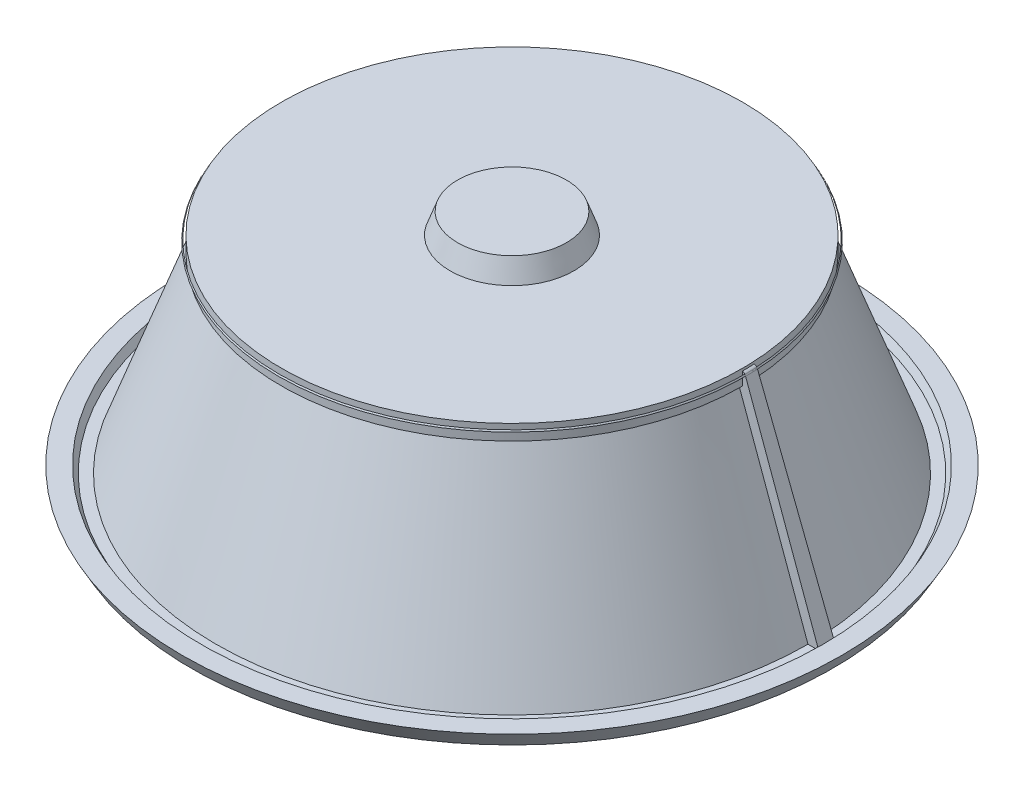
ISO-10303-21;
HEADER;
FILE_DESCRIPTION(('STEP AP214'),'2;1');
FILE_NAME('part.step','',(''),(''),'','','');
FILE_SCHEMA(('AUTOMOTIVE_DESIGN { 1 0 10303 214 1 1 1 1 }'));
ENDSEC;
DATA;
#1=APPLICATION_CONTEXT('core data for automotive mechanical design processes');
#2=APPLICATION_PROTOCOL_DEFINITION('international standard','automotive_design',2000,#1);
#3=PRODUCT_CONTEXT('',#1,'mechanical');
#4=PRODUCT('Part','Part','',(#3));
#5=PRODUCT_RELATED_PRODUCT_CATEGORY('part','',(#4));
#6=PRODUCT_DEFINITION_FORMATION('','',#4);
#7=PRODUCT_DEFINITION_CONTEXT('part definition',#1,'design');
#8=PRODUCT_DEFINITION('design','',#6,#7);
#9=PRODUCT_DEFINITION_SHAPE('','',#8);
#10=(LENGTH_UNIT() NAMED_UNIT(*) SI_UNIT(.MILLI.,.METRE.));
#11=(NAMED_UNIT(*) PLANE_ANGLE_UNIT() SI_UNIT($,.RADIAN.));
#12=(NAMED_UNIT(*) SI_UNIT($,.STERADIAN.) SOLID_ANGLE_UNIT());
#13=UNCERTAINTY_MEASURE_WITH_UNIT(LENGTH_MEASURE(1.E-05),#10,'distance_accuracy_value','');
#14=(GEOMETRIC_REPRESENTATION_CONTEXT(3) GLOBAL_UNCERTAINTY_ASSIGNED_CONTEXT((#13)) GLOBAL_UNIT_ASSIGNED_CONTEXT((#10,
#11,#12)) REPRESENTATION_CONTEXT('',''));
#15=CARTESIAN_POINT('',(0.,0.,0.));
#16=DIRECTION('',(0.,0.,1.));
#17=DIRECTION('',(1.,0.,0.));
#18=AXIS2_PLACEMENT_3D('',#15,#16,#17);
#19=CARTESIAN_POINT('',(0.,510.28650056125,0.));
#20=DIRECTION('',(0.,-1.,0.));
#21=DIRECTION('',(0.,0.,-1.));
#22=AXIS2_PLACEMENT_3D('',#19,#20,#21);
#23=CONICAL_SURFACE('',#22,564.208131214711,0.505849474138413);
#24=CARTESIAN_POINT('',(0.,506.840402866513,0.));
#25=DIRECTION('',(0.,-1.,0.));
#26=DIRECTION('',(0.,0.,-1.));
#27=AXIS2_PLACEMENT_3D('',#24,#25,#26);
#28=CIRCLE('',#27,566.117001075133);
#29=CARTESIAN_POINT('',(0.,506.840402866513,-566.117001075133));
#30=VERTEX_POINT('',#29);
#31=EDGE_CURVE('E11',#30,#30,#28,.T.);
#32=ORIENTED_EDGE('',*,*,#31,.T.);
#33=EDGE_LOOP('',(#32));
#34=FACE_BOUND('',#33,.T.);
#35=CARTESIAN_POINT('',(0.,510.28650056125,0.));
#36=DIRECTION('',(0.,-1.,0.));
#37=DIRECTION('',(0.,0.,-1.));
#38=AXIS2_PLACEMENT_3D('',#35,#36,#37);
#39=CIRCLE('',#38,564.208131214711);
#40=CARTESIAN_POINT('',(0.,510.28650056125,-564.208131214711));
#41=VERTEX_POINT('',#40);
#42=EDGE_CURVE('E53',#41,#41,#39,.T.);
#43=ORIENTED_EDGE('',*,*,#42,.F.);
#44=EDGE_LOOP('',(#43));
#45=FACE_BOUND('',#44,.T.);
#46=ADVANCED_FACE('F47',(#34,#45),#23,.F.);
#47=CARTESIAN_POINT('',(0.,502.5258203143,0.));
#48=DIRECTION('',(0.,-1.,0.));
#49=DIRECTION('',(0.,0.,-1.));
#50=AXIS2_PLACEMENT_3D('',#47,#48,#49);
#51=TOROIDAL_SURFACE('',#50,554.262782938554,12.6149954510278);
#52=ORIENTED_EDGE('',*,*,#42,.T.);
#53=EDGE_LOOP('',(#52));
#54=FACE_BOUND('',#53,.T.);
#55=ORIENTED_EDGE('',*,*,#31,.F.);
#56=EDGE_LOOP('',(#55));
#57=FACE_BOUND('',#56,.T.);
#58=ADVANCED_FACE('F59',(#54,#57),#51,.T.);
#59=CLOSED_SHELL('',(#46,#58));
#60=MANIFOLD_SOLID_BREP('B2',#59);
#61=CARTESIAN_POINT('',(0.,20.,0.));
#62=DIRECTION('',(0.,1.,0.));
#63=DIRECTION('',(0.,0.,1.));
#64=AXIS2_PLACEMENT_3D('',#61,#62,#63);
#65=PLANE('',#64);
#66=CARTESIAN_POINT('',(-730.042366910368,20.,19.1168321620943));
#67=DIRECTION('',(0.,1.,0.));
#68=DIRECTION('',(0.,0.,1.));
#69=AXIS2_PLACEMENT_3D('',#66,#67,#68);
#70=CIRCLE('',#69,7.49999999999995);
#71=CARTESIAN_POINT('',(-730.042366910368,20.,26.6168321620942));
#72=VERTEX_POINT('',#71);
#73=EDGE_CURVE('E439',#72,#72,#70,.T.);
#74=ORIENTED_EDGE('',*,*,#73,.F.);
#75=EDGE_LOOP('',(#74));
#76=FACE_BOUND('',#75,.T.);
#77=CARTESIAN_POINT('',(0.,20.,0.));
#78=DIRECTION('',(0.,-1.,0.));
#79=DIRECTION('',(0.,0.,-1.));
#80=AXIS2_PLACEMENT_3D('',#77,#78,#79);
#81=CIRCLE('',#80,717.272823346812);
#82=CARTESIAN_POINT('',(717.272823346812,20.,0.));
#83=VERTEX_POINT('',#82);
#84=CARTESIAN_POINT('',(716.289825870927,20.,-37.5391590969316));
#85=VERTEX_POINT('',#84);
#86=EDGE_CURVE('E196',#83,#85,#81,.T.);
#87=ORIENTED_EDGE('',*,*,#86,.T.);
#88=DIRECTION('',(-0.998629534754574,0.,0.0523359562429439));
#89=VECTOR('',#88,1.);
#90=CARTESIAN_POINT('',(0.,20.0000000000004,0.));
#91=LINE('',#90,#89);
#92=CARTESIAN_POINT('',(742.293732723324,20.,-38.9019661077488));
#93=VERTEX_POINT('',#92);
#94=EDGE_CURVE('E181',#93,#85,#91,.T.);
#95=ORIENTED_EDGE('',*,*,#94,.F.);
#96=CARTESIAN_POINT('',(0.,20.,0.));
#97=DIRECTION('',(0.,-1.,0.));
#98=DIRECTION('',(0.,0.,-1.));
#99=AXIS2_PLACEMENT_3D('',#96,#97,#98);
#100=CIRCLE('',#99,743.312416556708);
#101=CARTESIAN_POINT('',(743.312416556708,20.,0.));
#102=VERTEX_POINT('',#101);
#103=EDGE_CURVE('E199',#102,#93,#100,.T.);
#104=ORIENTED_EDGE('',*,*,#103,.F.);
#105=DIRECTION('',(-1.,0.,0.));
#106=VECTOR('',#105,1.);
#107=CARTESIAN_POINT('',(0.,20.0000000000004,0.));
#108=LINE('',#107,#106);
#109=EDGE_CURVE('E165',#102,#83,#108,.T.);
#110=ORIENTED_EDGE('',*,*,#109,.T.);
#111=EDGE_LOOP('',(#87,#95,#104,#110));
#112=FACE_BOUND('',#111,.T.);
#113=ADVANCED_FACE('F79',(#76,#112),#65,.T.);
#114=CARTESIAN_POINT('',(0.,482.799423723823,0.));
#115=DIRECTION('',(0.,-1.,0.));
#116=DIRECTION('',(0.,0.,-1.));
#117=AXIS2_PLACEMENT_3D('',#114,#115,#116);
#118=CONICAL_SURFACE('',#117,548.82760867579,0.349065850398863);
#119=DIRECTION('',(0.341551416606003,-0.939692620785909,-0.0178999512552975));
#120=VECTOR('',#119,1.);
#121=CARTESIAN_POINT('',(638.918900237079,232.866597374915,-33.4843207033883));
#122=LINE('',#121,#120);
#123=CARTESIAN_POINT('',(548.07545951237,482.799423723823,-28.7234177125757));
#124=VERTEX_POINT('',#123);
#125=EDGE_CURVE('E178',#124,#85,#122,.T.);
#126=ORIENTED_EDGE('',*,*,#125,.T.);
#127=ORIENTED_EDGE('',*,*,#86,.F.);
#128=DIRECTION('',(0.342020143325666,-0.939692620785909,0.));
#129=VECTOR('',#128,1.);
#130=CARTESIAN_POINT('',(639.795718032816,232.866597374915,0.));
#131=LINE('',#130,#129);
#132=CARTESIAN_POINT('',(548.82760867579,482.799423723823,0.));
#133=VERTEX_POINT('',#132);
#134=EDGE_CURVE('E163',#133,#83,#131,.T.);
#135=ORIENTED_EDGE('',*,*,#134,.F.);
#136=CARTESIAN_POINT('',(0.,482.799423723823,0.));
#137=DIRECTION('',(0.,-1.,0.));
#138=DIRECTION('',(0.,0.,-1.));
#139=AXIS2_PLACEMENT_3D('',#136,#137,#138);
#140=CIRCLE('',#139,548.82760867579);
#141=EDGE_CURVE('E193',#133,#124,#140,.T.);
#142=ORIENTED_EDGE('',*,*,#141,.T.);
#143=EDGE_LOOP('',(#126,#127,#135,#142));
#144=FACE_BOUND('',#143,.T.);
#145=ADVANCED_FACE('F232',(#144),#118,.T.);
#146=CARTESIAN_POINT('',(2.68007518246977E-12,482.799423723823,0.));
#147=DIRECTION('',(0.,1.,0.));
#148=DIRECTION('',(0.,0.,1.));
#149=AXIS2_PLACEMENT_3D('',#146,#147,#148);
#150=PLANE('',#149);
#151=DIRECTION('',(-0.998629534754574,0.,0.0523359562429439));
#152=VECTOR('',#151,1.);
#153=CARTESIAN_POINT('',(2.67640223257707E-12,482.799423723826,-1.40264297477538E-13));
#154=LINE('',#153,#152);
#155=CARTESIAN_POINT('',(558.061754859915,482.799423723823,-29.2467772750051));
#156=VERTEX_POINT('',#155);
#157=EDGE_CURVE('E175',#156,#124,#154,.T.);
#158=ORIENTED_EDGE('',*,*,#157,.T.);
#159=ORIENTED_EDGE('',*,*,#141,.F.);
#160=DIRECTION('',(-1.,0.,0.));
#161=VECTOR('',#160,1.);
#162=CARTESIAN_POINT('',(2.68007518246977E-12,482.799423723826,0.));
#163=LINE('',#162,#161);
#164=CARTESIAN_POINT('',(558.82760867579,482.799423723823,0.));
#165=VERTEX_POINT('',#164);
#166=EDGE_CURVE('E158',#165,#133,#163,.T.);
#167=ORIENTED_EDGE('',*,*,#166,.F.);
#168=CARTESIAN_POINT('',(0.,482.799423723823,0.));
#169=DIRECTION('',(0.,-1.,0.));
#170=DIRECTION('',(0.,0.,-1.));
#171=AXIS2_PLACEMENT_3D('',#168,#169,#170);
#172=CIRCLE('',#171,558.82760867579);
#173=EDGE_CURVE('E190',#165,#156,#172,.T.);
#174=ORIENTED_EDGE('',*,*,#173,.T.);
#175=EDGE_LOOP('',(#158,#159,#167,#174));
#176=FACE_BOUND('',#175,.T.);
#177=ADVANCED_FACE('F238',(#176),#150,.F.);
#178=CARTESIAN_POINT('',(0.,0.,0.));
#179=DIRECTION('',(0.,-1.,0.));
#180=DIRECTION('',(0.,0.,-1.));
#181=AXIS2_PLACEMENT_3D('',#178,#179,#180);
#182=CYLINDRICAL_SURFACE('',#181,558.82760867579);
#183=CARTESIAN_POINT('',(0.,520.,0.));
#184=DIRECTION('',(0.,-1.,0.));
#185=DIRECTION('',(0.,0.,-1.));
#186=AXIS2_PLACEMENT_3D('',#183,#184,#185);
#187=CIRCLE('',#186,558.82760867579);
#188=CARTESIAN_POINT('',(0.,520.,-558.82760867579));
#189=VERTEX_POINT('',#188);
#190=EDGE_CURVE('E145',#189,#189,#187,.T.);
#191=ORIENTED_EDGE('',*,*,#190,.T.);
#192=EDGE_LOOP('',(#191));
#193=FACE_BOUND('',#192,.T.);
#194=DIRECTION('',(0.,-1.,0.));
#195=VECTOR('',#194,1.);
#196=CARTESIAN_POINT('',(558.061754859915,0.,-29.2467772750051));
#197=LINE('',#196,#195);
#198=CARTESIAN_POINT('',(558.061754859915,514.28594260185,-29.2467772750051));
#199=VERTEX_POINT('',#198);
#200=EDGE_CURVE('E172',#199,#156,#197,.T.);
#201=ORIENTED_EDGE('',*,*,#200,.T.);
#202=ORIENTED_EDGE('',*,*,#173,.F.);
#203=DIRECTION('',(0.,-1.,0.));
#204=VECTOR('',#203,1.);
#205=CARTESIAN_POINT('',(558.82760867579,0.,0.));
#206=LINE('',#205,#204);
#207=CARTESIAN_POINT('',(558.82760867579,514.28594260185,0.));
#208=VERTEX_POINT('',#207);
#209=EDGE_CURVE('E156',#208,#165,#206,.T.);
#210=ORIENTED_EDGE('',*,*,#209,.F.);
#211=CARTESIAN_POINT('',(0.,514.28594260185,0.));
#212=DIRECTION('',(0.,-1.,0.));
#213=DIRECTION('',(0.,0.,-1.));
#214=AXIS2_PLACEMENT_3D('',#211,#212,#213);
#215=CIRCLE('',#214,558.82760867579);
#216=EDGE_CURVE('E146',#199,#208,#215,.T.);
#217=ORIENTED_EDGE('',*,*,#216,.F.);
#218=EDGE_LOOP('',(#201,#202,#210,#217));
#219=FACE_BOUND('',#218,.T.);
#220=ADVANCED_FACE('F371',(#193,#219),#182,.T.);
#221=CARTESIAN_POINT('',(2.15703056918176E-13,520.,0.));
#222=DIRECTION('',(0.,-1.,0.));
#223=DIRECTION('',(0.,0.,-1.));
#224=AXIS2_PLACEMENT_3D('',#221,#222,#223);
#225=PLANE('',#224);
#226=CARTESIAN_POINT('',(0.,520.,0.));
#227=DIRECTION('',(0.,1.,0.));
#228=DIRECTION('',(0.,0.,1.));
#229=AXIS2_PLACEMENT_3D('',#226,#227,#228);
#230=CIRCLE('',#229,150.);
#231=CARTESIAN_POINT('',(0.,520.,150.));
#232=VERTEX_POINT('',#231);
#233=EDGE_CURVE('E45',#232,#232,#230,.T.);
#234=ORIENTED_EDGE('',*,*,#233,.F.);
#235=EDGE_LOOP('',(#234));
#236=FACE_BOUND('',#235,.T.);
#237=ORIENTED_EDGE('',*,*,#190,.F.);
#238=EDGE_LOOP('',(#237));
#239=FACE_BOUND('',#238,.T.);
#240=ADVANCED_FACE('F81',(#236,#239),#225,.F.);
#241=CARTESIAN_POINT('',(-1.11022302462516E-13,500.,0.));
#242=DIRECTION('',(0.,1.,0.));
#243=DIRECTION('',(0.,0.,1.));
#244=AXIS2_PLACEMENT_3D('',#241,#242,#243);
#245=PLANE('',#244);
#246=CARTESIAN_POINT('',(0.,500.,0.));
#247=DIRECTION('',(0.,-1.,0.));
#248=DIRECTION('',(0.,0.,-1.));
#249=AXIS2_PLACEMENT_3D('',#246,#247,#248);
#250=CIRCLE('',#249,500.);
#251=CARTESIAN_POINT('',(0.,500.,-500.));
#252=VERTEX_POINT('',#251);
#253=EDGE_CURVE('E83',#252,#252,#250,.T.);
#254=ORIENTED_EDGE('',*,*,#253,.T.);
#255=EDGE_LOOP('',(#254));
#256=FACE_BOUND('',#255,.T.);
#257=ADVANCED_FACE('F218',(#256),#245,.F.);
#258=CARTESIAN_POINT('',(0.,0.,0.));
#259=DIRECTION('',(0.,-1.,0.));
#260=DIRECTION('',(0.,0.,-1.));
#261=AXIS2_PLACEMENT_3D('',#258,#259,#260);
#262=CONICAL_SURFACE('',#261,681.985117133099,0.349065850398863);
#263=ORIENTED_EDGE('',*,*,#253,.F.);
#264=EDGE_LOOP('',(#263));
#265=FACE_BOUND('',#264,.T.);
#266=CARTESIAN_POINT('',(0.,0.,0.));
#267=DIRECTION('',(0.,-1.,0.));
#268=DIRECTION('',(0.,0.,-1.));
#269=AXIS2_PLACEMENT_3D('',#266,#267,#268);
#270=CIRCLE('',#269,681.985117133099);
#271=CARTESIAN_POINT('',(0.,0.,-681.985117133099));
#272=VERTEX_POINT('',#271);
#273=EDGE_CURVE('E211',#272,#272,#270,.T.);
#274=ORIENTED_EDGE('',*,*,#273,.T.);
#275=EDGE_LOOP('',(#274));
#276=FACE_BOUND('',#275,.T.);
#277=ADVANCED_FACE('F220',(#265,#276),#262,.F.);
#278=CARTESIAN_POINT('',(0.,0.,0.));
#279=DIRECTION('',(0.,1.,0.));
#280=DIRECTION('',(0.,0.,1.));
#281=AXIS2_PLACEMENT_3D('',#278,#279,#280);
#282=PLANE('',#281);
#283=CARTESIAN_POINT('',(-730.042366910368,0.,19.1168321620943));
#284=DIRECTION('',(0.,1.,0.));
#285=DIRECTION('',(0.,0.,1.));
#286=AXIS2_PLACEMENT_3D('',#283,#284,#285);
#287=CIRCLE('',#286,7.49999999999995);
#288=CARTESIAN_POINT('',(-730.042366910368,0.,26.6168321620942));
#289=VERTEX_POINT('',#288);
#290=EDGE_CURVE('E151',#289,#289,#287,.T.);
#291=ORIENTED_EDGE('',*,*,#290,.T.);
#292=EDGE_LOOP('',(#291));
#293=FACE_BOUND('',#292,.T.);
#294=ORIENTED_EDGE('',*,*,#273,.F.);
#295=EDGE_LOOP('',(#294));
#296=FACE_BOUND('',#295,.T.);
#297=CARTESIAN_POINT('',(0.,0.,0.));
#298=DIRECTION('',(0.,-1.,0.));
#299=DIRECTION('',(0.,0.,-1.));
#300=AXIS2_PLACEMENT_3D('',#297,#298,#299);
#301=CIRCLE('',#300,777.955923258893);
#302=CARTESIAN_POINT('',(0.,0.,-777.955923258893));
#303=VERTEX_POINT('',#302);
#304=EDGE_CURVE('E209',#303,#303,#301,.T.);
#305=ORIENTED_EDGE('',*,*,#304,.T.);
#306=EDGE_LOOP('',(#305));
#307=FACE_BOUND('',#306,.T.);
#308=ADVANCED_FACE('F222',(#293,#296,#307),#282,.F.);
#309=CARTESIAN_POINT('',(0.,0.,0.));
#310=DIRECTION('',(0.,1.,0.));
#311=DIRECTION('',(0.,0.,1.));
#312=AXIS2_PLACEMENT_3D('',#309,#310,#311);
#313=CONICAL_SURFACE('',#312,777.955923258893,0.513183034820205);
#314=CARTESIAN_POINT('',(0.,37.4237240780144,0.));
#315=DIRECTION('',(0.,-1.,0.));
#316=DIRECTION('',(0.,0.,-1.));
#317=AXIS2_PLACEMENT_3D('',#314,#315,#316);
#318=CIRCLE('',#317,799.045880829127);
#319=CARTESIAN_POINT('',(0.,37.4237240780144,-799.045880829127));
#320=VERTEX_POINT('',#319);
#321=EDGE_CURVE('E206',#320,#320,#318,.T.);
#322=ORIENTED_EDGE('',*,*,#321,.T.);
#323=EDGE_LOOP('',(#322));
#324=FACE_BOUND('',#323,.T.);
#325=ORIENTED_EDGE('',*,*,#304,.F.);
#326=EDGE_LOOP('',(#325));
#327=FACE_BOUND('',#326,.T.);
#328=ADVANCED_FACE('F228',(#324,#327),#313,.T.);
#329=CARTESIAN_POINT('',(0.,37.4237240780144,0.));
#330=DIRECTION('',(0.,1.,0.));
#331=DIRECTION('',(0.,0.,1.));
#332=AXIS2_PLACEMENT_3D('',#329,#330,#331);
#333=PLANE('',#332);
#334=CARTESIAN_POINT('',(0.,37.4237240780145,0.));
#335=DIRECTION('',(0.,-1.,0.));
#336=DIRECTION('',(0.,0.,-1.));
#337=AXIS2_PLACEMENT_3D('',#334,#335,#336);
#338=CIRCLE('',#337,753.131471463023);
#339=CARTESIAN_POINT('',(0.,37.4237240780145,-753.131471463023));
#340=VERTEX_POINT('',#339);
#341=EDGE_CURVE('E203',#340,#340,#338,.T.);
#342=ORIENTED_EDGE('',*,*,#341,.T.);
#343=EDGE_LOOP('',(#342));
#344=FACE_BOUND('',#343,.T.);
#345=ORIENTED_EDGE('',*,*,#321,.F.);
#346=EDGE_LOOP('',(#345));
#347=FACE_BOUND('',#346,.T.);
#348=ADVANCED_FACE('F248',(#344,#347),#333,.T.);
#349=CARTESIAN_POINT('',(0.,37.4237240780145,0.));
#350=DIRECTION('',(0.,1.,0.));
#351=DIRECTION('',(0.,0.,1.));
#352=AXIS2_PLACEMENT_3D('',#349,#350,#351);
#353=CONICAL_SURFACE('',#352,753.131471463023,0.513183034820206);
#354=EDGE_CURVE('E200',#93,#102,#100,.T.);
#355=ORIENTED_EDGE('',*,*,#354,.T.);
#356=ORIENTED_EDGE('',*,*,#103,.T.);
#357=EDGE_LOOP('',(#355,#356));
#358=FACE_BOUND('',#357,.T.);
#359=ORIENTED_EDGE('',*,*,#341,.F.);
#360=EDGE_LOOP('',(#359));
#361=FACE_BOUND('',#360,.T.);
#362=ADVANCED_FACE('F245',(#358,#361),#353,.F.);
#363=CARTESIAN_POINT('',(0.,510.28650056125,0.));
#364=DIRECTION('',(0.,-1.,0.));
#365=DIRECTION('',(0.,0.,-1.));
#366=AXIS2_PLACEMENT_3D('',#363,#364,#365);
#367=CONICAL_SURFACE('',#366,564.208131214711,0.505849474138438);
#368=CARTESIAN_POINT('',(0.,510.28650056125,0.));
#369=DIRECTION('',(0.,-1.,0.));
#370=DIRECTION('',(0.,0.,-1.));
#371=AXIS2_PLACEMENT_3D('',#368,#369,#370);
#372=CIRCLE('',#371,564.208131214711);
#373=CARTESIAN_POINT('',(563.434903579694,510.28650056125,-29.5283720671663));
#374=VERTEX_POINT('',#373);
#375=CARTESIAN_POINT('',(564.208131214711,510.28650056125,0.));
#376=VERTEX_POINT('',#375);
#377=EDGE_CURVE('E138',#374,#376,#372,.T.);
#378=ORIENTED_EDGE('',*,*,#377,.T.);
#379=DIRECTION('',(0.484550703757891,-0.874763176801431,0.));
#380=VECTOR('',#379,1.);
#381=CARTESIAN_POINT('',(648.031717115462,358.959125067298,0.));
#382=LINE('',#381,#380);
#383=CARTESIAN_POINT('',(566.117001075133,506.840402866513,0.));
#384=VERTEX_POINT('',#383);
#385=EDGE_CURVE('E140',#376,#384,#382,.T.);
#386=ORIENTED_EDGE('',*,*,#385,.T.);
#387=CARTESIAN_POINT('',(0.,506.840402866513,0.));
#388=DIRECTION('',(0.,-1.,0.));
#389=DIRECTION('',(0.,0.,-1.));
#390=AXIS2_PLACEMENT_3D('',#387,#388,#389);
#391=CIRCLE('',#390,566.117001075133);
#392=CARTESIAN_POINT('',(565.341157400315,506.840402866513,-29.6282745966548));
#393=VERTEX_POINT('',#392);
#394=EDGE_CURVE('E103',#393,#384,#391,.T.);
#395=ORIENTED_EDGE('',*,*,#394,.F.);
#396=DIRECTION('',(0.483886643858744,-0.874763176801431,-0.0253594244293607));
#397=VECTOR('',#396,1.);
#398=CARTESIAN_POINT('',(647.143612169222,358.959125067298,-33.9153595909947));
#399=LINE('',#398,#397);
#400=EDGE_CURVE('E142',#374,#393,#399,.T.);
#401=ORIENTED_EDGE('',*,*,#400,.F.);
#402=EDGE_LOOP('',(#378,#386,#395,#401));
#403=FACE_BOUND('',#402,.T.);
#404=ADVANCED_FACE('F139',(#403),#367,.T.);
#405=CARTESIAN_POINT('',(0.,502.5258203143,0.));
#406=DIRECTION('',(0.,-1.,0.));
#407=DIRECTION('',(0.,0.,-1.));
#408=AXIS2_PLACEMENT_3D('',#405,#406,#407);
#409=TOROIDAL_SURFACE('',#408,554.262782938554,12.6149954510278);
#410=ORIENTED_EDGE('',*,*,#216,.T.);
#411=CARTESIAN_POINT('',(554.262782938554,502.5258203143,0.));
#412=DIRECTION('',(0.,0.,1.));
#413=DIRECTION('',(1.,0.,0.));
#414=AXIS2_PLACEMENT_3D('',#411,#412,#413);
#415=CIRCLE('',#414,12.6149954510278);
#416=EDGE_CURVE('E95',#376,#208,#415,.T.);
#417=ORIENTED_EDGE('',*,*,#416,.F.);
#418=ORIENTED_EDGE('',*,*,#377,.F.);
#419=CARTESIAN_POINT('',(553.503185057704,502.5258203143,-29.0078727549645));
#420=DIRECTION('',(0.0523359562429439,0.,0.998629534754574));
#421=DIRECTION('',(0.998629534754574,0.,-0.0523359562429439));
#422=AXIS2_PLACEMENT_3D('',#419,#420,#421);
#423=CIRCLE('',#422,12.6149954510278);
#424=EDGE_CURVE('E170',#374,#199,#423,.T.);
#425=ORIENTED_EDGE('',*,*,#424,.T.);
#426=EDGE_LOOP('',(#410,#417,#418,#425));
#427=FACE_BOUND('',#426,.T.);
#428=ADVANCED_FACE('F153',(#427),#409,.T.);
#429=CARTESIAN_POINT('',(0.,20.,0.));
#430=DIRECTION('',(0.,-1.,0.));
#431=DIRECTION('',(0.,0.,-1.));
#432=AXIS2_PLACEMENT_3D('',#429,#430,#431);
#433=CONICAL_SURFACE('',#432,743.312416556708,0.349065850398863);
#434=DIRECTION('',(-0.341551416606003,0.939692620785909,0.0178999512552975));
#435=VECTOR('',#434,1.);
#436=CARTESIAN_POINT('',(661.880927835109,241.235561313215,-34.687709577637));
#437=LINE('',#436,#435);
#438=EDGE_CURVE('E183',#93,#393,#437,.T.);
#439=ORIENTED_EDGE('',*,*,#438,.T.);
#440=ORIENTED_EDGE('',*,*,#394,.T.);
#441=DIRECTION('',(-0.342020143325666,0.939692620785909,0.));
#442=VECTOR('',#441,1.);
#443=CARTESIAN_POINT('',(662.789257477524,241.235561313215,0.));
#444=LINE('',#443,#442);
#445=EDGE_CURVE('E150',#102,#384,#444,.T.);
#446=ORIENTED_EDGE('',*,*,#445,.F.);
#447=ORIENTED_EDGE('',*,*,#354,.F.);
#448=EDGE_LOOP('',(#439,#440,#446,#447));
#449=FACE_BOUND('',#448,.T.);
#450=ADVANCED_FACE('F286',(#449),#433,.T.);
#451=CARTESIAN_POINT('',(0.,0.,0.));
#452=DIRECTION('',(0.0523359562429439,0.,0.998629534754574));
#453=DIRECTION('',(0.998629534754574,0.,-0.0523359562429439));
#454=AXIS2_PLACEMENT_3D('',#451,#452,#453);
#455=PLANE('',#454);
#456=ORIENTED_EDGE('',*,*,#400,.T.);
#457=ORIENTED_EDGE('',*,*,#438,.F.);
#458=ORIENTED_EDGE('',*,*,#94,.T.);
#459=ORIENTED_EDGE('',*,*,#125,.F.);
#460=ORIENTED_EDGE('',*,*,#157,.F.);
#461=ORIENTED_EDGE('',*,*,#200,.F.);
#462=ORIENTED_EDGE('',*,*,#424,.F.);
#463=EDGE_LOOP('',(#456,#457,#458,#459,#460,#461,#462));
#464=FACE_BOUND('',#463,.T.);
#465=ADVANCED_FACE('F293',(#464),#455,.F.);
#466=CARTESIAN_POINT('',(0.,0.,0.));
#467=DIRECTION('',(0.,0.,1.));
#468=DIRECTION('',(1.,0.,0.));
#469=AXIS2_PLACEMENT_3D('',#466,#467,#468);
#470=PLANE('',#469);
#471=ORIENTED_EDGE('',*,*,#385,.F.);
#472=ORIENTED_EDGE('',*,*,#416,.T.);
#473=ORIENTED_EDGE('',*,*,#209,.T.);
#474=ORIENTED_EDGE('',*,*,#166,.T.);
#475=ORIENTED_EDGE('',*,*,#134,.T.);
#476=ORIENTED_EDGE('',*,*,#109,.F.);
#477=ORIENTED_EDGE('',*,*,#445,.T.);
#478=EDGE_LOOP('',(#471,#472,#473,#474,#475,#476,#477));
#479=FACE_BOUND('',#478,.T.);
#480=ADVANCED_FACE('F148',(#479),#470,.T.);
#481=CARTESIAN_POINT('',(-730.042366910368,0.,19.1168321620943));
#482=DIRECTION('',(0.,1.,0.));
#483=DIRECTION('',(0.,0.,1.));
#484=AXIS2_PLACEMENT_3D('',#481,#482,#483);
#485=CYLINDRICAL_SURFACE('',#484,7.49999999999995);
#486=ORIENTED_EDGE('',*,*,#290,.F.);
#487=EDGE_LOOP('',(#486));
#488=FACE_BOUND('',#487,.T.);
#489=ORIENTED_EDGE('',*,*,#73,.T.);
#490=EDGE_LOOP('',(#489));
#491=FACE_BOUND('',#490,.T.);
#492=ADVANCED_FACE('F308',(#488,#491),#485,.F.);
#493=CARTESIAN_POINT('',(0.,520.,0.));
#494=DIRECTION('',(0.,-1.,0.));
#495=DIRECTION('',(0.,0.,1.));
#496=AXIS2_PLACEMENT_3D('',#493,#494,#495);
#497=CONICAL_SURFACE('',#496,150.,0.349065850398867);
#498=CARTESIAN_POINT('',(0.,570.,0.));
#499=DIRECTION('',(0.,1.,0.));
#500=DIRECTION('',(0.,0.,1.));
#501=AXIS2_PLACEMENT_3D('',#498,#499,#500);
#502=CIRCLE('',#501,131.80148828669);
#503=CARTESIAN_POINT('',(0.,570.,131.80148828669));
#504=VERTEX_POINT('',#503);
#505=EDGE_CURVE('E438',#504,#504,#502,.T.);
#506=ORIENTED_EDGE('',*,*,#505,.F.);
#507=EDGE_LOOP('',(#506));
#508=FACE_BOUND('',#507,.T.);
#509=ORIENTED_EDGE('',*,*,#233,.T.);
#510=EDGE_LOOP('',(#509));
#511=FACE_BOUND('',#510,.T.);
#512=ADVANCED_FACE('F315',(#508,#511),#497,.T.);
#513=CARTESIAN_POINT('',(0.,570.,0.));
#514=DIRECTION('',(0.,1.,0.));
#515=DIRECTION('',(0.,0.,1.));
#516=AXIS2_PLACEMENT_3D('',#513,#514,#515);
#517=PLANE('',#516);
#518=ORIENTED_EDGE('',*,*,#505,.T.);
#519=EDGE_LOOP('',(#518));
#520=FACE_BOUND('',#519,.T.);
#521=ADVANCED_FACE('F324',(#520),#517,.T.);
#522=CLOSED_SHELL('',(#113,#145,#177,#220,#240,#257,#277,#308,#328,#348,#362,#404,#428,#450,
#465,#480,#492,#512,#521));
#523=MANIFOLD_SOLID_BREP('B6',#522);
#524=ADVANCED_BREP_SHAPE_REPRESENTATION('',(#18,#60,#523),#14);
#525=SHAPE_DEFINITION_REPRESENTATION(#9,#524);
ENDSEC;
END-ISO-10303-21;
